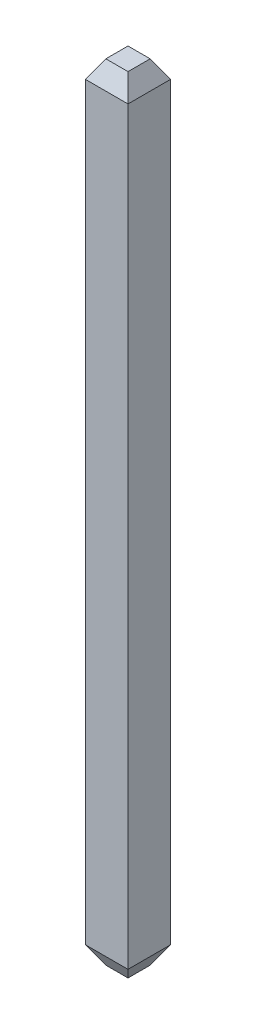
ISO-10303-21;
HEADER;
FILE_DESCRIPTION(('STEP AP214'),'2;1');
FILE_NAME('part.step','',(''),(''),'','','');
FILE_SCHEMA(('AUTOMOTIVE_DESIGN { 1 0 10303 214 1 1 1 1 }'));
ENDSEC;
DATA;
#1=APPLICATION_CONTEXT('core data for automotive mechanical design processes');
#2=APPLICATION_PROTOCOL_DEFINITION('international standard','automotive_design',2000,#1);
#3=PRODUCT_CONTEXT('',#1,'mechanical');
#4=PRODUCT('Part','Part','',(#3));
#5=PRODUCT_RELATED_PRODUCT_CATEGORY('part','',(#4));
#6=PRODUCT_DEFINITION_FORMATION('','',#4);
#7=PRODUCT_DEFINITION_CONTEXT('part definition',#1,'design');
#8=PRODUCT_DEFINITION('design','',#6,#7);
#9=PRODUCT_DEFINITION_SHAPE('','',#8);
#10=(LENGTH_UNIT() NAMED_UNIT(*) SI_UNIT(.MILLI.,.METRE.));
#11=(NAMED_UNIT(*) PLANE_ANGLE_UNIT() SI_UNIT($,.RADIAN.));
#12=(NAMED_UNIT(*) SI_UNIT($,.STERADIAN.) SOLID_ANGLE_UNIT());
#13=UNCERTAINTY_MEASURE_WITH_UNIT(LENGTH_MEASURE(1.E-05),#10,'distance_accuracy_value','');
#14=(GEOMETRIC_REPRESENTATION_CONTEXT(3) GLOBAL_UNCERTAINTY_ASSIGNED_CONTEXT((#13)) GLOBAL_UNIT_ASSIGNED_CONTEXT((#10,
#11,#12)) REPRESENTATION_CONTEXT('',''));
#15=CARTESIAN_POINT('',(0.,0.,0.));
#16=DIRECTION('',(0.,0.,1.));
#17=DIRECTION('',(1.,0.,0.));
#18=AXIS2_PLACEMENT_3D('',#15,#16,#17);
#19=CARTESIAN_POINT('',(7.3025,-5.58,-1.435));
#20=DIRECTION('',(0.,0.50000000000019,0.866025403784329));
#21=DIRECTION('',(1.,0.,0.));
#22=AXIS2_PLACEMENT_3D('',#19,#20,#21);
#23=PLANE('',#22);
#24=DIRECTION('',(-0.44721359550015,0.774596669241261,-0.44721359550015));
#25=VECTOR('',#24,1.);
#26=CARTESIAN_POINT('',(7.455,-5.58,-1.435));
#27=LINE('',#26,#25);
#28=CARTESIAN_POINT('',(7.455,-5.58,-1.435));
#29=VERTEX_POINT('',#28);
#30=CARTESIAN_POINT('',(7.3025,-5.31586225185,-1.5875));
#31=VERTEX_POINT('',#30);
#32=EDGE_CURVE('E269',#29,#31,#27,.T.);
#33=ORIENTED_EDGE('',*,*,#32,.T.);
#34=DIRECTION('',(1.,0.,0.));
#35=VECTOR('',#34,1.);
#36=CARTESIAN_POINT('',(7.3025,-5.31586225185,-1.5875));
#37=LINE('',#36,#35);
#38=CARTESIAN_POINT('',(7.9375,-5.31586225185,-1.5875));
#39=VERTEX_POINT('',#38);
#40=EDGE_CURVE('E182',#31,#39,#37,.T.);
#41=ORIENTED_EDGE('',*,*,#40,.T.);
#42=DIRECTION('',(0.44721359550015,0.774596669241261,-0.44721359550015));
#43=VECTOR('',#42,1.);
#44=CARTESIAN_POINT('',(7.785,-5.58,-1.435));
#45=LINE('',#44,#43);
#46=CARTESIAN_POINT('',(7.785,-5.58,-1.435));
#47=VERTEX_POINT('',#46);
#48=EDGE_CURVE('E27',#47,#39,#45,.T.);
#49=ORIENTED_EDGE('',*,*,#48,.F.);
#50=DIRECTION('',(1.,0.,0.));
#51=VECTOR('',#50,1.);
#52=CARTESIAN_POINT('',(7.455,-5.58,-1.435));
#53=LINE('',#52,#51);
#54=EDGE_CURVE('E270',#29,#47,#53,.T.);
#55=ORIENTED_EDGE('',*,*,#54,.F.);
#56=EDGE_LOOP('',(#33,#41,#49,#55));
#57=FACE_BOUND('',#56,.T.);
#58=ADVANCED_FACE('F16',(#57),#23,.F.);
#59=CARTESIAN_POINT('',(7.9375,-5.58,-1.105));
#60=DIRECTION('',(0.,0.50000000000019,-0.866025403784329));
#61=DIRECTION('',(-1.,0.,0.));
#62=AXIS2_PLACEMENT_3D('',#59,#60,#61);
#63=PLANE('',#62);
#64=DIRECTION('',(0.44721359550015,0.774596669241261,0.44721359550015));
#65=VECTOR('',#64,1.);
#66=CARTESIAN_POINT('',(7.785,-5.58,-1.105));
#67=LINE('',#66,#65);
#68=CARTESIAN_POINT('',(7.785,-5.58,-1.105));
#69=VERTEX_POINT('',#68);
#70=CARTESIAN_POINT('',(7.9375,-5.31586225185,-0.9525));
#71=VERTEX_POINT('',#70);
#72=EDGE_CURVE('E11',#69,#71,#67,.T.);
#73=ORIENTED_EDGE('',*,*,#72,.T.);
#74=DIRECTION('',(-1.,0.,0.));
#75=VECTOR('',#74,1.);
#76=CARTESIAN_POINT('',(7.9375,-5.31586225185,-0.9525));
#77=LINE('',#76,#75);
#78=CARTESIAN_POINT('',(7.3025,-5.31586225185,-0.9525));
#79=VERTEX_POINT('',#78);
#80=EDGE_CURVE('E157',#71,#79,#77,.T.);
#81=ORIENTED_EDGE('',*,*,#80,.T.);
#82=DIRECTION('',(-0.44721359550015,0.774596669241261,0.44721359550015));
#83=VECTOR('',#82,1.);
#84=CARTESIAN_POINT('',(7.455,-5.58,-1.105));
#85=LINE('',#84,#83);
#86=CARTESIAN_POINT('',(7.455,-5.58,-1.105));
#87=VERTEX_POINT('',#86);
#88=EDGE_CURVE('E20',#87,#79,#85,.T.);
#89=ORIENTED_EDGE('',*,*,#88,.F.);
#90=DIRECTION('',(-1.,0.,0.));
#91=VECTOR('',#90,1.);
#92=CARTESIAN_POINT('',(7.785,-5.58,-1.105));
#93=LINE('',#92,#91);
#94=EDGE_CURVE('E146',#69,#87,#93,.T.);
#95=ORIENTED_EDGE('',*,*,#94,.F.);
#96=EDGE_LOOP('',(#73,#81,#89,#95));
#97=FACE_BOUND('',#96,.T.);
#98=ADVANCED_FACE('F369',(#97),#63,.F.);
#99=CARTESIAN_POINT('',(7.785,-5.58,-1.5875));
#100=DIRECTION('',(-0.866025403784329,0.50000000000019,0.));
#101=DIRECTION('',(0.,0.,1.));
#102=AXIS2_PLACEMENT_3D('',#99,#100,#101);
#103=PLANE('',#102);
#104=ORIENTED_EDGE('',*,*,#48,.T.);
#105=DIRECTION('',(0.,0.,1.));
#106=VECTOR('',#105,1.);
#107=CARTESIAN_POINT('',(7.9375,-5.31586225185,-1.5875));
#108=LINE('',#107,#106);
#109=EDGE_CURVE('E156',#39,#71,#108,.T.);
#110=ORIENTED_EDGE('',*,*,#109,.T.);
#111=ORIENTED_EDGE('',*,*,#72,.F.);
#112=DIRECTION('',(0.,0.,1.));
#113=VECTOR('',#112,1.);
#114=CARTESIAN_POINT('',(7.785,-5.58,-1.435));
#115=LINE('',#114,#113);
#116=EDGE_CURVE('E264',#47,#69,#115,.T.);
#117=ORIENTED_EDGE('',*,*,#116,.F.);
#118=EDGE_LOOP('',(#104,#110,#111,#117));
#119=FACE_BOUND('',#118,.T.);
#120=ADVANCED_FACE('F262',(#119),#103,.F.);
#121=CARTESIAN_POINT('',(7.62,-5.58,-1.27));
#122=DIRECTION('',(0.,-1.,0.));
#123=DIRECTION('',(0.,0.,-1.));
#124=AXIS2_PLACEMENT_3D('',#121,#122,#123);
#125=PLANE('',#124);
#126=ORIENTED_EDGE('',*,*,#94,.T.);
#127=DIRECTION('',(0.,0.,-1.));
#128=VECTOR('',#127,1.);
#129=CARTESIAN_POINT('',(7.455,-5.58,-1.105));
#130=LINE('',#129,#128);
#131=EDGE_CURVE('E275',#87,#29,#130,.T.);
#132=ORIENTED_EDGE('',*,*,#131,.T.);
#133=ORIENTED_EDGE('',*,*,#54,.T.);
#134=ORIENTED_EDGE('',*,*,#116,.T.);
#135=EDGE_LOOP('',(#126,#132,#133,#134));
#136=FACE_BOUND('',#135,.T.);
#137=ADVANCED_FACE('F418',(#136),#125,.T.);
#138=CARTESIAN_POINT('',(7.455,-5.58,-0.9525));
#139=DIRECTION('',(0.866025403784329,0.50000000000019,0.));
#140=DIRECTION('',(0.,0.,-1.));
#141=AXIS2_PLACEMENT_3D('',#138,#139,#140);
#142=PLANE('',#141);
#143=ORIENTED_EDGE('',*,*,#88,.T.);
#144=DIRECTION('',(0.,0.,-1.));
#145=VECTOR('',#144,1.);
#146=CARTESIAN_POINT('',(7.3025,-5.31586225185,-0.9525));
#147=LINE('',#146,#145);
#148=EDGE_CURVE('E148',#79,#31,#147,.T.);
#149=ORIENTED_EDGE('',*,*,#148,.T.);
#150=ORIENTED_EDGE('',*,*,#32,.F.);
#151=ORIENTED_EDGE('',*,*,#131,.F.);
#152=EDGE_LOOP('',(#143,#149,#150,#151));
#153=FACE_BOUND('',#152,.T.);
#154=ADVANCED_FACE('F18',(#153),#142,.F.);
#155=CARTESIAN_POINT('',(7.3025,6.1,-0.9525));
#156=DIRECTION('',(-1.,0.,0.));
#157=DIRECTION('',(0.,0.,1.));
#158=AXIS2_PLACEMENT_3D('',#155,#156,#157);
#159=PLANE('',#158);
#160=DIRECTION('',(0.,-1.,0.));
#161=VECTOR('',#160,1.);
#162=CARTESIAN_POINT('',(7.3025,5.835862251846,-1.5875));
#163=LINE('',#162,#161);
#164=CARTESIAN_POINT('',(7.3025,5.835862251846,-1.5875));
#165=VERTEX_POINT('',#164);
#166=EDGE_CURVE('E91',#165,#31,#163,.T.);
#167=ORIENTED_EDGE('',*,*,#166,.T.);
#168=ORIENTED_EDGE('',*,*,#148,.F.);
#169=DIRECTION('',(0.,-1.,0.));
#170=VECTOR('',#169,1.);
#171=CARTESIAN_POINT('',(7.3025,5.835862251846,-0.9525));
#172=LINE('',#171,#170);
#173=CARTESIAN_POINT('',(7.3025,5.835862251846,-0.9525));
#174=VERTEX_POINT('',#173);
#175=EDGE_CURVE('E76',#174,#79,#172,.T.);
#176=ORIENTED_EDGE('',*,*,#175,.F.);
#177=DIRECTION('',(0.,0.,-1.));
#178=VECTOR('',#177,1.);
#179=CARTESIAN_POINT('',(7.3025,5.835862251846,-0.9525));
#180=LINE('',#179,#178);
#181=EDGE_CURVE('E117',#174,#165,#180,.T.);
#182=ORIENTED_EDGE('',*,*,#181,.T.);
#183=EDGE_LOOP('',(#167,#168,#176,#182));
#184=FACE_BOUND('',#183,.T.);
#185=ADVANCED_FACE('F277',(#184),#159,.T.);
#186=CARTESIAN_POINT('',(7.3025,6.1,-1.5875));
#187=DIRECTION('',(0.,0.,-1.));
#188=DIRECTION('',(0.,-1.,0.));
#189=AXIS2_PLACEMENT_3D('',#186,#187,#188);
#190=PLANE('',#189);
#191=DIRECTION('',(0.,-1.,0.));
#192=VECTOR('',#191,1.);
#193=CARTESIAN_POINT('',(7.9375,5.835862251846,-1.5875));
#194=LINE('',#193,#192);
#195=CARTESIAN_POINT('',(7.9375,5.835862251846,-1.5875));
#196=VERTEX_POINT('',#195);
#197=EDGE_CURVE('E161',#196,#39,#194,.T.);
#198=ORIENTED_EDGE('',*,*,#197,.T.);
#199=ORIENTED_EDGE('',*,*,#40,.F.);
#200=ORIENTED_EDGE('',*,*,#166,.F.);
#201=DIRECTION('',(1.,0.,0.));
#202=VECTOR('',#201,1.);
#203=CARTESIAN_POINT('',(7.3025,5.835862251846,-1.5875));
#204=LINE('',#203,#202);
#205=EDGE_CURVE('E162',#165,#196,#204,.T.);
#206=ORIENTED_EDGE('',*,*,#205,.T.);
#207=EDGE_LOOP('',(#198,#199,#200,#206));
#208=FACE_BOUND('',#207,.T.);
#209=ADVANCED_FACE('F257',(#208),#190,.T.);
#210=CARTESIAN_POINT('',(7.9375,6.1,-1.5875));
#211=DIRECTION('',(1.,0.,0.));
#212=DIRECTION('',(0.,1.,0.));
#213=AXIS2_PLACEMENT_3D('',#210,#211,#212);
#214=PLANE('',#213);
#215=DIRECTION('',(0.,-1.,0.));
#216=VECTOR('',#215,1.);
#217=CARTESIAN_POINT('',(7.9375,5.835862251846,-0.9525));
#218=LINE('',#217,#216);
#219=CARTESIAN_POINT('',(7.9375,5.835862251846,-0.9525));
#220=VERTEX_POINT('',#219);
#221=EDGE_CURVE('E152',#220,#71,#218,.T.);
#222=ORIENTED_EDGE('',*,*,#221,.T.);
#223=ORIENTED_EDGE('',*,*,#109,.F.);
#224=ORIENTED_EDGE('',*,*,#197,.F.);
#225=DIRECTION('',(0.,0.,1.));
#226=VECTOR('',#225,1.);
#227=CARTESIAN_POINT('',(7.9375,5.835862251846,-1.5875));
#228=LINE('',#227,#226);
#229=EDGE_CURVE('E169',#196,#220,#228,.T.);
#230=ORIENTED_EDGE('',*,*,#229,.T.);
#231=EDGE_LOOP('',(#222,#223,#224,#230));
#232=FACE_BOUND('',#231,.T.);
#233=ADVANCED_FACE('F260',(#232),#214,.T.);
#234=CARTESIAN_POINT('',(7.9375,6.1,-0.9525));
#235=DIRECTION('',(0.,0.,1.));
#236=DIRECTION('',(1.,0.,0.));
#237=AXIS2_PLACEMENT_3D('',#234,#235,#236);
#238=PLANE('',#237);
#239=ORIENTED_EDGE('',*,*,#175,.T.);
#240=ORIENTED_EDGE('',*,*,#80,.F.);
#241=ORIENTED_EDGE('',*,*,#221,.F.);
#242=DIRECTION('',(-1.,0.,0.));
#243=VECTOR('',#242,1.);
#244=CARTESIAN_POINT('',(7.9375,5.835862251846,-0.9525));
#245=LINE('',#244,#243);
#246=EDGE_CURVE('E121',#220,#174,#245,.T.);
#247=ORIENTED_EDGE('',*,*,#246,.T.);
#248=EDGE_LOOP('',(#239,#240,#241,#247));
#249=FACE_BOUND('',#248,.T.);
#250=ADVANCED_FACE('F378',(#249),#238,.T.);
#251=CARTESIAN_POINT('',(7.9375,6.1,-1.105));
#252=DIRECTION('',(0.,0.50000000000019,0.866025403784329));
#253=DIRECTION('',(1.,0.,0.));
#254=AXIS2_PLACEMENT_3D('',#251,#252,#253);
#255=PLANE('',#254);
#256=DIRECTION('',(-0.44721359550015,-0.774596669241261,0.44721359550015));
#257=VECTOR('',#256,1.);
#258=CARTESIAN_POINT('',(7.455,6.1,-1.105));
#259=LINE('',#258,#257);
#260=CARTESIAN_POINT('',(7.455,6.1,-1.105));
#261=VERTEX_POINT('',#260);
#262=EDGE_CURVE('E110',#261,#174,#259,.T.);
#263=ORIENTED_EDGE('',*,*,#262,.T.);
#264=ORIENTED_EDGE('',*,*,#246,.F.);
#265=DIRECTION('',(0.44721359550015,-0.774596669241261,0.44721359550015));
#266=VECTOR('',#265,1.);
#267=CARTESIAN_POINT('',(7.785,6.1,-1.105));
#268=LINE('',#267,#266);
#269=CARTESIAN_POINT('',(7.785,6.1,-1.105));
#270=VERTEX_POINT('',#269);
#271=EDGE_CURVE('E127',#270,#220,#268,.T.);
#272=ORIENTED_EDGE('',*,*,#271,.F.);
#273=DIRECTION('',(-1.,0.,0.));
#274=VECTOR('',#273,1.);
#275=CARTESIAN_POINT('',(7.785,6.1,-1.105));
#276=LINE('',#275,#274);
#277=EDGE_CURVE('E124',#270,#261,#276,.T.);
#278=ORIENTED_EDGE('',*,*,#277,.T.);
#279=EDGE_LOOP('',(#263,#264,#272,#278));
#280=FACE_BOUND('',#279,.T.);
#281=ADVANCED_FACE('F125',(#280),#255,.T.);
#282=CARTESIAN_POINT('',(7.455,6.1,-0.9525));
#283=DIRECTION('',(-0.866025403784329,0.50000000000019,0.));
#284=DIRECTION('',(0.,0.,1.));
#285=AXIS2_PLACEMENT_3D('',#282,#283,#284);
#286=PLANE('',#285);
#287=DIRECTION('',(-0.44721359550015,-0.774596669241261,-0.44721359550015));
#288=VECTOR('',#287,1.);
#289=CARTESIAN_POINT('',(7.455,6.1,-1.435));
#290=LINE('',#289,#288);
#291=CARTESIAN_POINT('',(7.455,6.1,-1.435));
#292=VERTEX_POINT('',#291);
#293=EDGE_CURVE('E164',#292,#165,#290,.T.);
#294=ORIENTED_EDGE('',*,*,#293,.T.);
#295=ORIENTED_EDGE('',*,*,#181,.F.);
#296=ORIENTED_EDGE('',*,*,#262,.F.);
#297=DIRECTION('',(0.,0.,-1.));
#298=VECTOR('',#297,1.);
#299=CARTESIAN_POINT('',(7.455,6.1,-1.105));
#300=LINE('',#299,#298);
#301=EDGE_CURVE('E115',#261,#292,#300,.T.);
#302=ORIENTED_EDGE('',*,*,#301,.T.);
#303=EDGE_LOOP('',(#294,#295,#296,#302));
#304=FACE_BOUND('',#303,.T.);
#305=ADVANCED_FACE('F113',(#304),#286,.T.);
#306=CARTESIAN_POINT('',(7.3025,6.1,-1.435));
#307=DIRECTION('',(0.,0.50000000000019,-0.866025403784329));
#308=DIRECTION('',(-1.,0.,0.));
#309=AXIS2_PLACEMENT_3D('',#306,#307,#308);
#310=PLANE('',#309);
#311=DIRECTION('',(0.44721359550015,-0.774596669241261,-0.44721359550015));
#312=VECTOR('',#311,1.);
#313=CARTESIAN_POINT('',(7.785,6.1,-1.435));
#314=LINE('',#313,#312);
#315=CARTESIAN_POINT('',(7.785,6.1,-1.435));
#316=VERTEX_POINT('',#315);
#317=EDGE_CURVE('E165',#316,#196,#314,.T.);
#318=ORIENTED_EDGE('',*,*,#317,.T.);
#319=ORIENTED_EDGE('',*,*,#205,.F.);
#320=ORIENTED_EDGE('',*,*,#293,.F.);
#321=DIRECTION('',(1.,0.,0.));
#322=VECTOR('',#321,1.);
#323=CARTESIAN_POINT('',(7.455,6.1,-1.435));
#324=LINE('',#323,#322);
#325=EDGE_CURVE('E136',#292,#316,#324,.T.);
#326=ORIENTED_EDGE('',*,*,#325,.T.);
#327=EDGE_LOOP('',(#318,#319,#320,#326));
#328=FACE_BOUND('',#327,.T.);
#329=ADVANCED_FACE('F209',(#328),#310,.T.);
#330=CARTESIAN_POINT('',(7.785,6.1,-1.5875));
#331=DIRECTION('',(0.866025403784329,0.50000000000019,0.));
#332=DIRECTION('',(0.,0.,-1.));
#333=AXIS2_PLACEMENT_3D('',#330,#331,#332);
#334=PLANE('',#333);
#335=ORIENTED_EDGE('',*,*,#271,.T.);
#336=ORIENTED_EDGE('',*,*,#229,.F.);
#337=ORIENTED_EDGE('',*,*,#317,.F.);
#338=DIRECTION('',(0.,0.,1.));
#339=VECTOR('',#338,1.);
#340=CARTESIAN_POINT('',(7.785,6.1,-1.435));
#341=LINE('',#340,#339);
#342=EDGE_CURVE('E132',#316,#270,#341,.T.);
#343=ORIENTED_EDGE('',*,*,#342,.T.);
#344=EDGE_LOOP('',(#335,#336,#337,#343));
#345=FACE_BOUND('',#344,.T.);
#346=ADVANCED_FACE('F205',(#345),#334,.T.);
#347=CARTESIAN_POINT('',(7.62,6.1,-1.27));
#348=DIRECTION('',(0.,-1.,0.));
#349=DIRECTION('',(0.,0.,-1.));
#350=AXIS2_PLACEMENT_3D('',#347,#348,#349);
#351=PLANE('',#350);
#352=ORIENTED_EDGE('',*,*,#325,.F.);
#353=ORIENTED_EDGE('',*,*,#301,.F.);
#354=ORIENTED_EDGE('',*,*,#277,.F.);
#355=ORIENTED_EDGE('',*,*,#342,.F.);
#356=EDGE_LOOP('',(#352,#353,#354,#355));
#357=FACE_BOUND('',#356,.T.);
#358=ADVANCED_FACE('F134',(#357),#351,.F.);
#359=CLOSED_SHELL('',(#58,#98,#120,#137,#154,#185,#209,#233,#250,#281,#305,#329,#346,#358));
#360=MANIFOLD_SOLID_BREP('B1',#359);
#361=ADVANCED_BREP_SHAPE_REPRESENTATION('',(#18,#360),#14);
#362=SHAPE_DEFINITION_REPRESENTATION(#9,#361);
ENDSEC;
END-ISO-10303-21;
